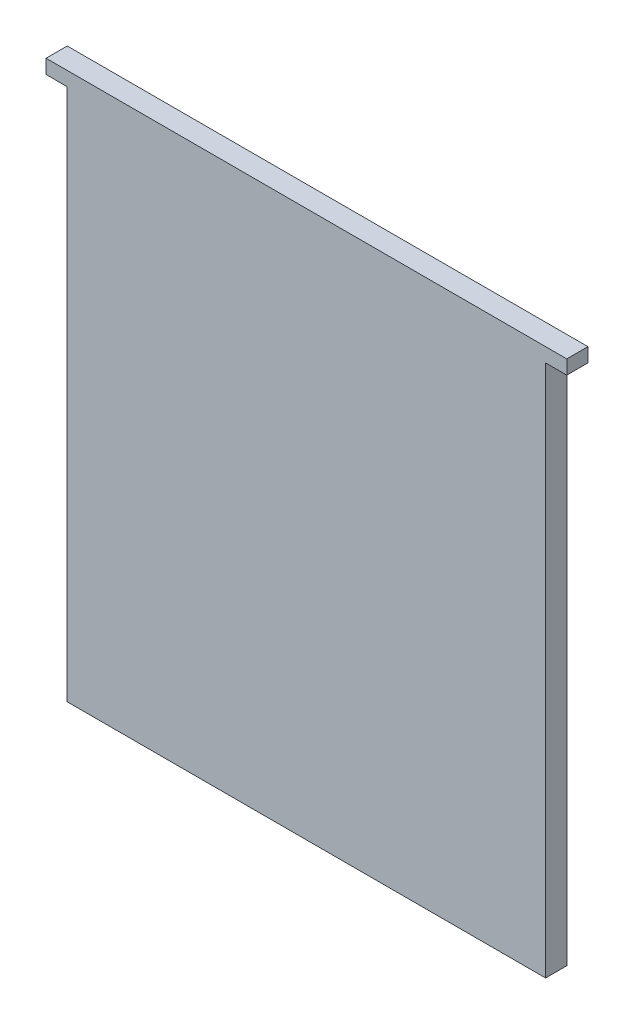
ISO-10303-21;
HEADER;
FILE_DESCRIPTION(('STEP AP214'),'2;1');
FILE_NAME('part.step','',(''),(''),'','','');
FILE_SCHEMA(('AUTOMOTIVE_DESIGN { 1 0 10303 214 1 1 1 1 }'));
ENDSEC;
DATA;
#1=APPLICATION_CONTEXT('core data for automotive mechanical design processes');
#2=APPLICATION_PROTOCOL_DEFINITION('international standard','automotive_design',2000,#1);
#3=PRODUCT_CONTEXT('',#1,'mechanical');
#4=PRODUCT('Part','Part','',(#3));
#5=PRODUCT_RELATED_PRODUCT_CATEGORY('part','',(#4));
#6=PRODUCT_DEFINITION_FORMATION('','',#4);
#7=PRODUCT_DEFINITION_CONTEXT('part definition',#1,'design');
#8=PRODUCT_DEFINITION('design','',#6,#7);
#9=PRODUCT_DEFINITION_SHAPE('','',#8);
#10=(LENGTH_UNIT() NAMED_UNIT(*) SI_UNIT(.MILLI.,.METRE.));
#11=(NAMED_UNIT(*) PLANE_ANGLE_UNIT() SI_UNIT($,.RADIAN.));
#12=(NAMED_UNIT(*) SI_UNIT($,.STERADIAN.) SOLID_ANGLE_UNIT());
#13=UNCERTAINTY_MEASURE_WITH_UNIT(LENGTH_MEASURE(1.E-05),#10,'distance_accuracy_value','');
#14=(GEOMETRIC_REPRESENTATION_CONTEXT(3) GLOBAL_UNCERTAINTY_ASSIGNED_CONTEXT((#13)) GLOBAL_UNIT_ASSIGNED_CONTEXT((#10,
#11,#12)) REPRESENTATION_CONTEXT('',''));
#15=CARTESIAN_POINT('',(0.,0.,0.));
#16=DIRECTION('',(0.,0.,1.));
#17=DIRECTION('',(1.,0.,0.));
#18=AXIS2_PLACEMENT_3D('',#15,#16,#17);
#19=CARTESIAN_POINT('',(-33.9,-38.75,3.));
#20=DIRECTION('',(1.,0.,0.));
#21=DIRECTION('',(0.,0.,-1.));
#22=AXIS2_PLACEMENT_3D('',#19,#20,#21);
#23=PLANE('',#22);
#24=DIRECTION('',(0.,0.,1.));
#25=VECTOR('',#24,1.);
#26=CARTESIAN_POINT('',(-33.9,36.75,0.));
#27=LINE('',#26,#25);
#28=CARTESIAN_POINT('',(-33.9,36.75,0.));
#29=VERTEX_POINT('',#28);
#30=CARTESIAN_POINT('',(-33.9,36.75,3.));
#31=VERTEX_POINT('',#30);
#32=EDGE_CURVE('E53',#29,#31,#27,.T.);
#33=ORIENTED_EDGE('',*,*,#32,.F.);
#34=DIRECTION('',(0.,-1.,0.));
#35=VECTOR('',#34,1.);
#36=CARTESIAN_POINT('',(-33.9,-38.75,0.));
#37=LINE('',#36,#35);
#38=CARTESIAN_POINT('',(-33.9,-38.75,0.));
#39=VERTEX_POINT('',#38);
#40=EDGE_CURVE('E158',#29,#39,#37,.T.);
#41=ORIENTED_EDGE('',*,*,#40,.T.);
#42=DIRECTION('',(0.,0.,-1.));
#43=VECTOR('',#42,1.);
#44=CARTESIAN_POINT('',(-33.9,-38.75,3.));
#45=LINE('',#44,#43);
#46=CARTESIAN_POINT('',(-33.9,-38.75,3.));
#47=VERTEX_POINT('',#46);
#48=EDGE_CURVE('E11',#47,#39,#45,.T.);
#49=ORIENTED_EDGE('',*,*,#48,.F.);
#50=DIRECTION('',(0.,-1.,0.));
#51=VECTOR('',#50,1.);
#52=CARTESIAN_POINT('',(-33.9,-38.75,3.));
#53=LINE('',#52,#51);
#54=EDGE_CURVE('E101',#31,#47,#53,.T.);
#55=ORIENTED_EDGE('',*,*,#54,.F.);
#56=EDGE_LOOP('',(#33,#41,#49,#55));
#57=FACE_BOUND('',#56,.T.);
#58=ADVANCED_FACE('F38',(#57),#23,.F.);
#59=CARTESIAN_POINT('',(33.9,-38.75,3.));
#60=DIRECTION('',(-1.,0.,0.));
#61=DIRECTION('',(0.,0.,1.));
#62=AXIS2_PLACEMENT_3D('',#59,#60,#61);
#63=PLANE('',#62);
#64=DIRECTION('',(0.,1.,0.));
#65=VECTOR('',#64,1.);
#66=CARTESIAN_POINT('',(33.9,-38.75,0.));
#67=LINE('',#66,#65);
#68=CARTESIAN_POINT('',(33.9,-38.75,0.));
#69=VERTEX_POINT('',#68);
#70=CARTESIAN_POINT('',(33.9,36.75,0.));
#71=VERTEX_POINT('',#70);
#72=EDGE_CURVE('E145',#69,#71,#67,.T.);
#73=ORIENTED_EDGE('',*,*,#72,.T.);
#74=DIRECTION('',(0.,0.,1.));
#75=VECTOR('',#74,1.);
#76=CARTESIAN_POINT('',(33.9,36.75,0.));
#77=LINE('',#76,#75);
#78=CARTESIAN_POINT('',(33.9,36.75,3.));
#79=VERTEX_POINT('',#78);
#80=EDGE_CURVE('E138',#71,#79,#77,.T.);
#81=ORIENTED_EDGE('',*,*,#80,.T.);
#82=DIRECTION('',(0.,1.,0.));
#83=VECTOR('',#82,1.);
#84=CARTESIAN_POINT('',(33.9,-38.75,3.));
#85=LINE('',#84,#83);
#86=CARTESIAN_POINT('',(33.9,-38.75,3.));
#87=VERTEX_POINT('',#86);
#88=EDGE_CURVE('E149',#87,#79,#85,.T.);
#89=ORIENTED_EDGE('',*,*,#88,.F.);
#90=DIRECTION('',(0.,0.,-1.));
#91=VECTOR('',#90,1.);
#92=CARTESIAN_POINT('',(33.9,-38.75,3.));
#93=LINE('',#92,#91);
#94=EDGE_CURVE('E46',#87,#69,#93,.T.);
#95=ORIENTED_EDGE('',*,*,#94,.T.);
#96=EDGE_LOOP('',(#73,#81,#89,#95));
#97=FACE_BOUND('',#96,.T.);
#98=ADVANCED_FACE('F40',(#97),#63,.F.);
#99=CARTESIAN_POINT('',(-33.9,38.75,3.));
#100=DIRECTION('',(0.,-1.,0.));
#101=DIRECTION('',(0.,0.,-1.));
#102=AXIS2_PLACEMENT_3D('',#99,#100,#101);
#103=PLANE('',#102);
#104=DIRECTION('',(-1.,0.,0.));
#105=VECTOR('',#104,1.);
#106=CARTESIAN_POINT('',(-33.9,38.75,0.));
#107=LINE('',#106,#105);
#108=CARTESIAN_POINT('',(36.9,38.75,0.));
#109=VERTEX_POINT('',#108);
#110=CARTESIAN_POINT('',(-36.9,38.75,0.));
#111=VERTEX_POINT('',#110);
#112=EDGE_CURVE('E156',#109,#111,#107,.T.);
#113=ORIENTED_EDGE('',*,*,#112,.T.);
#114=DIRECTION('',(0.,0.,1.));
#115=VECTOR('',#114,1.);
#116=CARTESIAN_POINT('',(-36.9,38.75,0.));
#117=LINE('',#116,#115);
#118=CARTESIAN_POINT('',(-36.9,38.75,3.));
#119=VERTEX_POINT('',#118);
#120=EDGE_CURVE('E129',#111,#119,#117,.T.);
#121=ORIENTED_EDGE('',*,*,#120,.T.);
#122=DIRECTION('',(-1.,0.,0.));
#123=VECTOR('',#122,1.);
#124=CARTESIAN_POINT('',(-33.9,38.75,3.));
#125=LINE('',#124,#123);
#126=CARTESIAN_POINT('',(36.9,38.75,3.));
#127=VERTEX_POINT('',#126);
#128=EDGE_CURVE('E106',#127,#119,#125,.T.);
#129=ORIENTED_EDGE('',*,*,#128,.F.);
#130=DIRECTION('',(0.,0.,1.));
#131=VECTOR('',#130,1.);
#132=CARTESIAN_POINT('',(36.9,38.75,0.));
#133=LINE('',#132,#131);
#134=EDGE_CURVE('E142',#109,#127,#133,.T.);
#135=ORIENTED_EDGE('',*,*,#134,.F.);
#136=EDGE_LOOP('',(#113,#121,#129,#135));
#137=FACE_BOUND('',#136,.T.);
#138=ADVANCED_FACE('F175',(#137),#103,.F.);
#139=CARTESIAN_POINT('',(-33.9,-38.75,3.));
#140=DIRECTION('',(0.,1.,0.));
#141=DIRECTION('',(0.,0.,1.));
#142=AXIS2_PLACEMENT_3D('',#139,#140,#141);
#143=PLANE('',#142);
#144=DIRECTION('',(1.,0.,0.));
#145=VECTOR('',#144,1.);
#146=CARTESIAN_POINT('',(-33.9,-38.75,0.));
#147=LINE('',#146,#145);
#148=EDGE_CURVE('E151',#39,#69,#147,.T.);
#149=ORIENTED_EDGE('',*,*,#148,.T.);
#150=ORIENTED_EDGE('',*,*,#94,.F.);
#151=DIRECTION('',(1.,0.,0.));
#152=VECTOR('',#151,1.);
#153=CARTESIAN_POINT('',(-33.9,-38.75,3.));
#154=LINE('',#153,#152);
#155=EDGE_CURVE('E105',#47,#87,#154,.T.);
#156=ORIENTED_EDGE('',*,*,#155,.F.);
#157=ORIENTED_EDGE('',*,*,#48,.T.);
#158=EDGE_LOOP('',(#149,#150,#156,#157));
#159=FACE_BOUND('',#158,.T.);
#160=ADVANCED_FACE('F173',(#159),#143,.F.);
#161=CARTESIAN_POINT('',(0.,0.,3.));
#162=DIRECTION('',(0.,0.,-1.));
#163=DIRECTION('',(-1.,0.,0.));
#164=AXIS2_PLACEMENT_3D('',#161,#162,#163);
#165=PLANE('',#164);
#166=ORIENTED_EDGE('',*,*,#88,.T.);
#167=DIRECTION('',(1.,0.,0.));
#168=VECTOR('',#167,1.);
#169=CARTESIAN_POINT('',(33.9,36.75,3.));
#170=LINE('',#169,#168);
#171=CARTESIAN_POINT('',(36.9,36.75,3.));
#172=VERTEX_POINT('',#171);
#173=EDGE_CURVE('E61',#79,#172,#170,.T.);
#174=ORIENTED_EDGE('',*,*,#173,.T.);
#175=DIRECTION('',(0.,1.,0.));
#176=VECTOR('',#175,1.);
#177=CARTESIAN_POINT('',(36.9,38.75,3.));
#178=LINE('',#177,#176);
#179=EDGE_CURVE('E135',#172,#127,#178,.T.);
#180=ORIENTED_EDGE('',*,*,#179,.T.);
#181=ORIENTED_EDGE('',*,*,#128,.T.);
#182=DIRECTION('',(0.,-1.,0.));
#183=VECTOR('',#182,1.);
#184=CARTESIAN_POINT('',(-36.9,38.75,3.));
#185=LINE('',#184,#183);
#186=CARTESIAN_POINT('',(-36.9,36.75,3.));
#187=VERTEX_POINT('',#186);
#188=EDGE_CURVE('E121',#119,#187,#185,.T.);
#189=ORIENTED_EDGE('',*,*,#188,.T.);
#190=DIRECTION('',(1.,0.,0.));
#191=VECTOR('',#190,1.);
#192=CARTESIAN_POINT('',(-33.9,36.75,3.));
#193=LINE('',#192,#191);
#194=EDGE_CURVE('E112',#187,#31,#193,.T.);
#195=ORIENTED_EDGE('',*,*,#194,.T.);
#196=ORIENTED_EDGE('',*,*,#54,.T.);
#197=ORIENTED_EDGE('',*,*,#155,.T.);
#198=EDGE_LOOP('',(#166,#174,#180,#181,#189,#195,#196,#197));
#199=FACE_BOUND('',#198,.T.);
#200=ADVANCED_FACE('F119',(#199),#165,.F.);
#201=CARTESIAN_POINT('',(0.,0.,0.));
#202=DIRECTION('',(0.,0.,-1.));
#203=DIRECTION('',(-1.,0.,0.));
#204=AXIS2_PLACEMENT_3D('',#201,#202,#203);
#205=PLANE('',#204);
#206=ORIENTED_EDGE('',*,*,#72,.F.);
#207=ORIENTED_EDGE('',*,*,#148,.F.);
#208=ORIENTED_EDGE('',*,*,#40,.F.);
#209=DIRECTION('',(1.,0.,0.));
#210=VECTOR('',#209,1.);
#211=CARTESIAN_POINT('',(-33.9,36.75,0.));
#212=LINE('',#211,#210);
#213=CARTESIAN_POINT('',(-36.9,36.75,0.));
#214=VERTEX_POINT('',#213);
#215=EDGE_CURVE('E115',#214,#29,#212,.T.);
#216=ORIENTED_EDGE('',*,*,#215,.F.);
#217=DIRECTION('',(0.,-1.,0.));
#218=VECTOR('',#217,1.);
#219=CARTESIAN_POINT('',(-36.9,38.75,0.));
#220=LINE('',#219,#218);
#221=EDGE_CURVE('E122',#111,#214,#220,.T.);
#222=ORIENTED_EDGE('',*,*,#221,.F.);
#223=ORIENTED_EDGE('',*,*,#112,.F.);
#224=DIRECTION('',(0.,1.,0.));
#225=VECTOR('',#224,1.);
#226=CARTESIAN_POINT('',(36.9,38.75,0.));
#227=LINE('',#226,#225);
#228=CARTESIAN_POINT('',(36.9,36.75,0.));
#229=VERTEX_POINT('',#228);
#230=EDGE_CURVE('E134',#229,#109,#227,.T.);
#231=ORIENTED_EDGE('',*,*,#230,.F.);
#232=DIRECTION('',(1.,0.,0.));
#233=VECTOR('',#232,1.);
#234=CARTESIAN_POINT('',(33.9,36.75,0.));
#235=LINE('',#234,#233);
#236=EDGE_CURVE('E131',#71,#229,#235,.T.);
#237=ORIENTED_EDGE('',*,*,#236,.F.);
#238=EDGE_LOOP('',(#206,#207,#208,#216,#222,#223,#231,#237));
#239=FACE_BOUND('',#238,.T.);
#240=ADVANCED_FACE('F169',(#239),#205,.T.);
#241=CARTESIAN_POINT('',(36.9,38.75,0.));
#242=DIRECTION('',(1.,0.,0.));
#243=DIRECTION('',(0.,0.,-1.));
#244=AXIS2_PLACEMENT_3D('',#241,#242,#243);
#245=PLANE('',#244);
#246=ORIENTED_EDGE('',*,*,#179,.F.);
#247=DIRECTION('',(0.,0.,1.));
#248=VECTOR('',#247,1.);
#249=CARTESIAN_POINT('',(36.9,36.75,0.));
#250=LINE('',#249,#248);
#251=EDGE_CURVE('E146',#229,#172,#250,.T.);
#252=ORIENTED_EDGE('',*,*,#251,.F.);
#253=ORIENTED_EDGE('',*,*,#230,.T.);
#254=ORIENTED_EDGE('',*,*,#134,.T.);
#255=EDGE_LOOP('',(#246,#252,#253,#254));
#256=FACE_BOUND('',#255,.T.);
#257=ADVANCED_FACE('F210',(#256),#245,.T.);
#258=CARTESIAN_POINT('',(33.9,36.75,0.));
#259=DIRECTION('',(0.,-1.,0.));
#260=DIRECTION('',(0.,0.,-1.));
#261=AXIS2_PLACEMENT_3D('',#258,#259,#260);
#262=PLANE('',#261);
#263=ORIENTED_EDGE('',*,*,#173,.F.);
#264=ORIENTED_EDGE('',*,*,#80,.F.);
#265=ORIENTED_EDGE('',*,*,#236,.T.);
#266=ORIENTED_EDGE('',*,*,#251,.T.);
#267=EDGE_LOOP('',(#263,#264,#265,#266));
#268=FACE_BOUND('',#267,.T.);
#269=ADVANCED_FACE('F171',(#268),#262,.T.);
#270=CARTESIAN_POINT('',(-33.9,36.75,0.));
#271=DIRECTION('',(0.,-1.,0.));
#272=DIRECTION('',(0.,0.,-1.));
#273=AXIS2_PLACEMENT_3D('',#270,#271,#272);
#274=PLANE('',#273);
#275=ORIENTED_EDGE('',*,*,#194,.F.);
#276=DIRECTION('',(0.,0.,1.));
#277=VECTOR('',#276,1.);
#278=CARTESIAN_POINT('',(-36.9,36.75,0.));
#279=LINE('',#278,#277);
#280=EDGE_CURVE('E116',#214,#187,#279,.T.);
#281=ORIENTED_EDGE('',*,*,#280,.F.);
#282=ORIENTED_EDGE('',*,*,#215,.T.);
#283=ORIENTED_EDGE('',*,*,#32,.T.);
#284=EDGE_LOOP('',(#275,#281,#282,#283));
#285=FACE_BOUND('',#284,.T.);
#286=ADVANCED_FACE('F111',(#285),#274,.T.);
#287=CARTESIAN_POINT('',(-36.9,38.75,0.));
#288=DIRECTION('',(-1.,0.,0.));
#289=DIRECTION('',(0.,0.,1.));
#290=AXIS2_PLACEMENT_3D('',#287,#288,#289);
#291=PLANE('',#290);
#292=ORIENTED_EDGE('',*,*,#188,.F.);
#293=ORIENTED_EDGE('',*,*,#120,.F.);
#294=ORIENTED_EDGE('',*,*,#221,.T.);
#295=ORIENTED_EDGE('',*,*,#280,.T.);
#296=EDGE_LOOP('',(#292,#293,#294,#295));
#297=FACE_BOUND('',#296,.T.);
#298=ADVANCED_FACE('F231',(#297),#291,.T.);
#299=CLOSED_SHELL('',(#58,#98,#138,#160,#200,#240,#257,#269,#286,#298));
#300=MANIFOLD_SOLID_BREP('B2',#299);
#301=ADVANCED_BREP_SHAPE_REPRESENTATION('',(#18,#300),#14);
#302=SHAPE_DEFINITION_REPRESENTATION(#9,#301);
ENDSEC;
END-ISO-10303-21;
